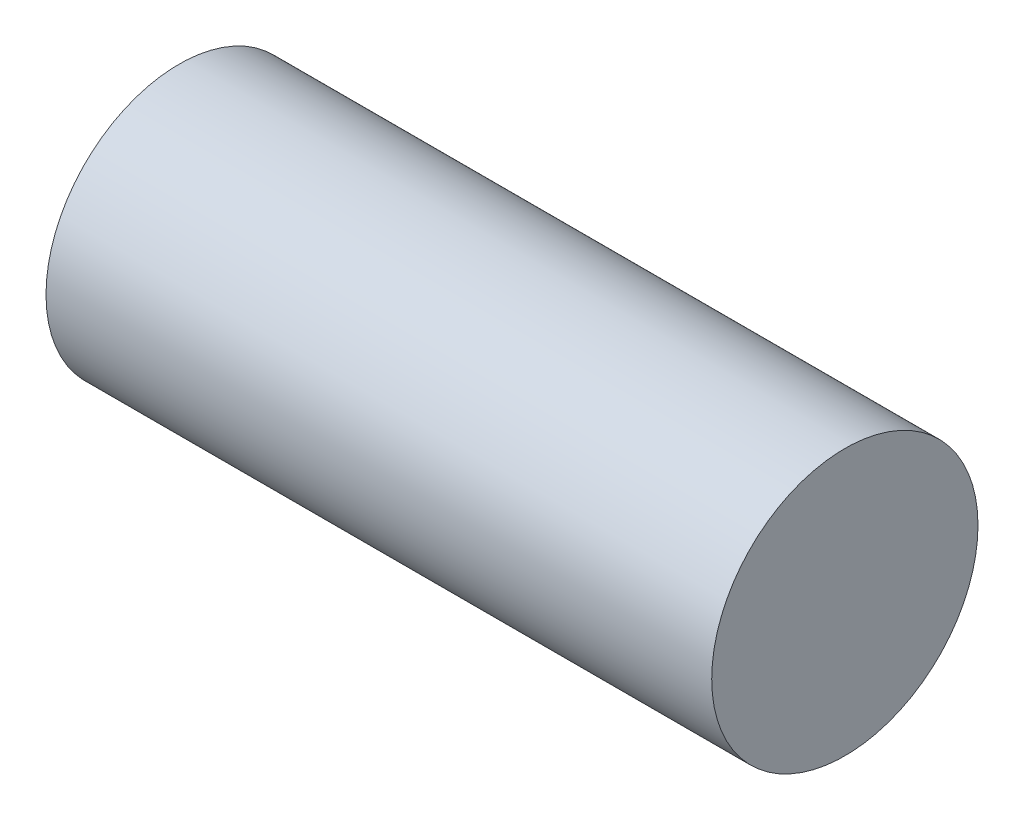
ISO-10303-21;
HEADER;
FILE_DESCRIPTION(('STEP AP214'),'2;1');
FILE_NAME('part.step','',(''),(''),'','','');
FILE_SCHEMA(('AUTOMOTIVE_DESIGN { 1 0 10303 214 1 1 1 1 }'));
ENDSEC;
DATA;
#1=APPLICATION_CONTEXT('core data for automotive mechanical design processes');
#2=APPLICATION_PROTOCOL_DEFINITION('international standard','automotive_design',2000,#1);
#3=PRODUCT_CONTEXT('',#1,'mechanical');
#4=PRODUCT('Part','Part','',(#3));
#5=PRODUCT_RELATED_PRODUCT_CATEGORY('part','',(#4));
#6=PRODUCT_DEFINITION_FORMATION('','',#4);
#7=PRODUCT_DEFINITION_CONTEXT('part definition',#1,'design');
#8=PRODUCT_DEFINITION('design','',#6,#7);
#9=PRODUCT_DEFINITION_SHAPE('','',#8);
#10=(LENGTH_UNIT() NAMED_UNIT(*) SI_UNIT(.MILLI.,.METRE.));
#11=(NAMED_UNIT(*) PLANE_ANGLE_UNIT() SI_UNIT($,.RADIAN.));
#12=(NAMED_UNIT(*) SI_UNIT($,.STERADIAN.) SOLID_ANGLE_UNIT());
#13=UNCERTAINTY_MEASURE_WITH_UNIT(LENGTH_MEASURE(1.E-05),#10,'distance_accuracy_value','');
#14=(GEOMETRIC_REPRESENTATION_CONTEXT(3) GLOBAL_UNCERTAINTY_ASSIGNED_CONTEXT((#13)) GLOBAL_UNIT_ASSIGNED_CONTEXT((#10,
#11,#12)) REPRESENTATION_CONTEXT('',''));
#15=CARTESIAN_POINT('',(0.,0.,0.));
#16=DIRECTION('',(0.,0.,1.));
#17=DIRECTION('',(1.,0.,0.));
#18=AXIS2_PLACEMENT_3D('',#15,#16,#17);
#19=CARTESIAN_POINT('',(200.,0.,0.));
#20=DIRECTION('',(-1.,0.,0.));
#21=DIRECTION('',(0.,0.,1.));
#22=AXIS2_PLACEMENT_3D('',#19,#20,#21);
#23=CYLINDRICAL_SURFACE('',#22,40.);
#24=CARTESIAN_POINT('',(200.,0.,0.));
#25=DIRECTION('',(1.,0.,0.));
#26=DIRECTION('',(0.,0.,-1.));
#27=AXIS2_PLACEMENT_3D('',#24,#25,#26);
#28=CIRCLE('',#27,40.);
#29=CARTESIAN_POINT('',(200.,0.,-40.));
#30=VERTEX_POINT('',#29);
#31=EDGE_CURVE('E10',#30,#30,#28,.T.);
#32=ORIENTED_EDGE('',*,*,#31,.F.);
#33=EDGE_LOOP('',(#32));
#34=FACE_BOUND('',#33,.T.);
#35=CARTESIAN_POINT('',(0.,0.,0.));
#36=DIRECTION('',(1.,0.,0.));
#37=DIRECTION('',(0.,0.,-1.));
#38=AXIS2_PLACEMENT_3D('',#35,#36,#37);
#39=CIRCLE('',#38,40.);
#40=CARTESIAN_POINT('',(0.,0.,-40.));
#41=VERTEX_POINT('',#40);
#42=EDGE_CURVE('E40',#41,#41,#39,.T.);
#43=ORIENTED_EDGE('',*,*,#42,.T.);
#44=EDGE_LOOP('',(#43));
#45=FACE_BOUND('',#44,.T.);
#46=ADVANCED_FACE('F37',(#34,#45),#23,.T.);
#47=CARTESIAN_POINT('',(200.,0.,0.));
#48=DIRECTION('',(1.,0.,0.));
#49=DIRECTION('',(0.,0.,-1.));
#50=AXIS2_PLACEMENT_3D('',#47,#48,#49);
#51=PLANE('',#50);
#52=ORIENTED_EDGE('',*,*,#31,.T.);
#53=EDGE_LOOP('',(#52));
#54=FACE_BOUND('',#53,.T.);
#55=ADVANCED_FACE('F52',(#54),#51,.T.);
#56=CARTESIAN_POINT('',(0.,0.,0.));
#57=DIRECTION('',(1.,0.,0.));
#58=DIRECTION('',(0.,0.,-1.));
#59=AXIS2_PLACEMENT_3D('',#56,#57,#58);
#60=PLANE('',#59);
#61=ORIENTED_EDGE('',*,*,#42,.F.);
#62=EDGE_LOOP('',(#61));
#63=FACE_BOUND('',#62,.T.);
#64=ADVANCED_FACE('F50',(#63),#60,.F.);
#65=CLOSED_SHELL('',(#46,#55,#64));
#66=MANIFOLD_SOLID_BREP('B2',#65);
#67=ADVANCED_BREP_SHAPE_REPRESENTATION('',(#18,#66),#14);
#68=SHAPE_DEFINITION_REPRESENTATION(#9,#67);
ENDSEC;
END-ISO-10303-21;
